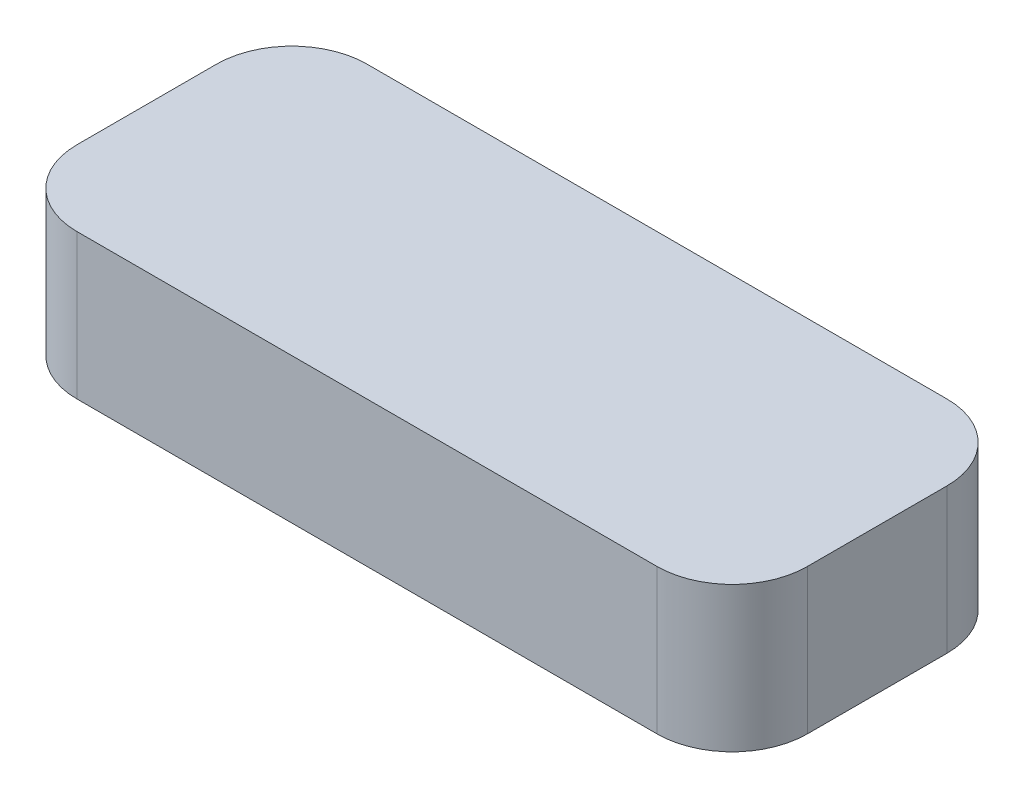
ISO-10303-21;
HEADER;
FILE_DESCRIPTION(('STEP AP214'),'2;1');
FILE_NAME('part.step','',(''),(''),'','','');
FILE_SCHEMA(('AUTOMOTIVE_DESIGN { 1 0 10303 214 1 1 1 1 }'));
ENDSEC;
DATA;
#1=APPLICATION_CONTEXT('core data for automotive mechanical design processes');
#2=APPLICATION_PROTOCOL_DEFINITION('international standard','automotive_design',2000,#1);
#3=PRODUCT_CONTEXT('',#1,'mechanical');
#4=PRODUCT('Part','Part','',(#3));
#5=PRODUCT_RELATED_PRODUCT_CATEGORY('part','',(#4));
#6=PRODUCT_DEFINITION_FORMATION('','',#4);
#7=PRODUCT_DEFINITION_CONTEXT('part definition',#1,'design');
#8=PRODUCT_DEFINITION('design','',#6,#7);
#9=PRODUCT_DEFINITION_SHAPE('','',#8);
#10=(LENGTH_UNIT() NAMED_UNIT(*) SI_UNIT(.MILLI.,.METRE.));
#11=(NAMED_UNIT(*) PLANE_ANGLE_UNIT() SI_UNIT($,.RADIAN.));
#12=(NAMED_UNIT(*) SI_UNIT($,.STERADIAN.) SOLID_ANGLE_UNIT());
#13=UNCERTAINTY_MEASURE_WITH_UNIT(LENGTH_MEASURE(1.E-05),#10,'distance_accuracy_value','');
#14=(GEOMETRIC_REPRESENTATION_CONTEXT(3) GLOBAL_UNCERTAINTY_ASSIGNED_CONTEXT((#13)) GLOBAL_UNIT_ASSIGNED_CONTEXT((#10,
#11,#12)) REPRESENTATION_CONTEXT('',''));
#15=CARTESIAN_POINT('',(0.,0.,0.));
#16=DIRECTION('',(0.,0.,1.));
#17=DIRECTION('',(1.,0.,0.));
#18=AXIS2_PLACEMENT_3D('',#15,#16,#17);
#19=CARTESIAN_POINT('',(215.9,85.725,85.725));
#20=DIRECTION('',(-1.,0.,0.));
#21=DIRECTION('',(0.,0.,1.));
#22=AXIS2_PLACEMENT_3D('',#19,#20,#21);
#23=PLANE('',#22);
#24=DIRECTION('',(0.,0.,-1.));
#25=VECTOR('',#24,1.);
#26=CARTESIAN_POINT('',(215.9,0.,85.725));
#27=LINE('',#26,#25);
#28=CARTESIAN_POINT('',(215.9,0.,41.275));
#29=VERTEX_POINT('',#28);
#30=CARTESIAN_POINT('',(215.9,0.,-41.275));
#31=VERTEX_POINT('',#30);
#32=EDGE_CURVE('E234',#29,#31,#27,.T.);
#33=ORIENTED_EDGE('',*,*,#32,.T.);
#34=DIRECTION('',(0.,-1.,0.));
#35=VECTOR('',#34,1.);
#36=CARTESIAN_POINT('',(215.9,85.725,-41.275));
#37=LINE('',#36,#35);
#38=CARTESIAN_POINT('',(215.9,85.725,-41.275));
#39=VERTEX_POINT('',#38);
#40=EDGE_CURVE('E287',#31,#39,#37,.F.);
#41=ORIENTED_EDGE('',*,*,#40,.T.);
#42=DIRECTION('',(0.,0.,-1.));
#43=VECTOR('',#42,1.);
#44=CARTESIAN_POINT('',(215.9,85.725,85.725));
#45=LINE('',#44,#43);
#46=CARTESIAN_POINT('',(215.9,85.725,41.275));
#47=VERTEX_POINT('',#46);
#48=EDGE_CURVE('E236',#47,#39,#45,.T.);
#49=ORIENTED_EDGE('',*,*,#48,.F.);
#50=DIRECTION('',(0.,-1.,0.));
#51=VECTOR('',#50,1.);
#52=CARTESIAN_POINT('',(215.9,85.725,41.275));
#53=LINE('',#52,#51);
#54=EDGE_CURVE('E283',#47,#29,#53,.T.);
#55=ORIENTED_EDGE('',*,*,#54,.T.);
#56=EDGE_LOOP('',(#33,#41,#49,#55));
#57=FACE_BOUND('',#56,.T.);
#58=ADVANCED_FACE('F44',(#57),#23,.F.);
#59=CARTESIAN_POINT('',(-215.9,85.725,-85.725));
#60=DIRECTION('',(0.,0.,1.));
#61=DIRECTION('',(1.,0.,0.));
#62=AXIS2_PLACEMENT_3D('',#59,#60,#61);
#63=PLANE('',#62);
#64=DIRECTION('',(-1.,0.,0.));
#65=VECTOR('',#64,1.);
#66=CARTESIAN_POINT('',(-215.9,85.725,-85.725));
#67=LINE('',#66,#65);
#68=CARTESIAN_POINT('',(171.45,85.725,-85.725));
#69=VERTEX_POINT('',#68);
#70=CARTESIAN_POINT('',(-171.45,85.725,-85.725));
#71=VERTEX_POINT('',#70);
#72=EDGE_CURVE('E240',#69,#71,#67,.T.);
#73=ORIENTED_EDGE('',*,*,#72,.F.);
#74=DIRECTION('',(0.,-1.,0.));
#75=VECTOR('',#74,1.);
#76=CARTESIAN_POINT('',(171.45,85.725,-85.725));
#77=LINE('',#76,#75);
#78=CARTESIAN_POINT('',(171.45,0.,-85.725));
#79=VERTEX_POINT('',#78);
#80=EDGE_CURVE('E267',#69,#79,#77,.T.);
#81=ORIENTED_EDGE('',*,*,#80,.T.);
#82=DIRECTION('',(-1.,0.,0.));
#83=VECTOR('',#82,1.);
#84=CARTESIAN_POINT('',(-215.9,0.,-85.725));
#85=LINE('',#84,#83);
#86=CARTESIAN_POINT('',(-171.45,0.,-85.725));
#87=VERTEX_POINT('',#86);
#88=EDGE_CURVE('E255',#79,#87,#85,.T.);
#89=ORIENTED_EDGE('',*,*,#88,.T.);
#90=DIRECTION('',(0.,-1.,0.));
#91=VECTOR('',#90,1.);
#92=CARTESIAN_POINT('',(-171.45,85.725,-85.725));
#93=LINE('',#92,#91);
#94=EDGE_CURVE('E251',#87,#71,#93,.F.);
#95=ORIENTED_EDGE('',*,*,#94,.T.);
#96=EDGE_LOOP('',(#73,#81,#89,#95));
#97=FACE_BOUND('',#96,.T.);
#98=ADVANCED_FACE('F338',(#97),#63,.F.);
#99=CARTESIAN_POINT('',(-215.9,85.725,85.725));
#100=DIRECTION('',(1.,0.,0.));
#101=DIRECTION('',(0.,0.,-1.));
#102=AXIS2_PLACEMENT_3D('',#99,#100,#101);
#103=PLANE('',#102);
#104=DIRECTION('',(0.,0.,1.));
#105=VECTOR('',#104,1.);
#106=CARTESIAN_POINT('',(-215.9,0.,85.725));
#107=LINE('',#106,#105);
#108=CARTESIAN_POINT('',(-215.9,0.,-41.275));
#109=VERTEX_POINT('',#108);
#110=CARTESIAN_POINT('',(-215.9,0.,41.275));
#111=VERTEX_POINT('',#110);
#112=EDGE_CURVE('E259',#109,#111,#107,.T.);
#113=ORIENTED_EDGE('',*,*,#112,.T.);
#114=DIRECTION('',(0.,-1.,0.));
#115=VECTOR('',#114,1.);
#116=CARTESIAN_POINT('',(-215.9,85.725,41.275));
#117=LINE('',#116,#115);
#118=CARTESIAN_POINT('',(-215.9,85.725,41.275));
#119=VERTEX_POINT('',#118);
#120=EDGE_CURVE('E12',#111,#119,#117,.F.);
#121=ORIENTED_EDGE('',*,*,#120,.T.);
#122=DIRECTION('',(0.,0.,1.));
#123=VECTOR('',#122,1.);
#124=CARTESIAN_POINT('',(-215.9,85.725,85.725));
#125=LINE('',#124,#123);
#126=CARTESIAN_POINT('',(-215.9,85.725,-41.275));
#127=VERTEX_POINT('',#126);
#128=EDGE_CURVE('E245',#127,#119,#125,.T.);
#129=ORIENTED_EDGE('',*,*,#128,.F.);
#130=DIRECTION('',(0.,-1.,0.));
#131=VECTOR('',#130,1.);
#132=CARTESIAN_POINT('',(-215.9,85.725,-41.275));
#133=LINE('',#132,#131);
#134=EDGE_CURVE('E53',#127,#109,#133,.T.);
#135=ORIENTED_EDGE('',*,*,#134,.T.);
#136=EDGE_LOOP('',(#113,#121,#129,#135));
#137=FACE_BOUND('',#136,.T.);
#138=ADVANCED_FACE('F313',(#137),#103,.F.);
#139=CARTESIAN_POINT('',(-215.9,85.725,85.725));
#140=DIRECTION('',(0.,0.,-1.));
#141=DIRECTION('',(-1.,0.,0.));
#142=AXIS2_PLACEMENT_3D('',#139,#140,#141);
#143=PLANE('',#142);
#144=DIRECTION('',(1.,0.,0.));
#145=VECTOR('',#144,1.);
#146=CARTESIAN_POINT('',(-215.9,0.,85.725));
#147=LINE('',#146,#145);
#148=CARTESIAN_POINT('',(-171.45,0.,85.725));
#149=VERTEX_POINT('',#148);
#150=CARTESIAN_POINT('',(171.45,0.,85.725));
#151=VERTEX_POINT('',#150);
#152=EDGE_CURVE('E241',#149,#151,#147,.T.);
#153=ORIENTED_EDGE('',*,*,#152,.T.);
#154=DIRECTION('',(0.,-1.,0.));
#155=VECTOR('',#154,1.);
#156=CARTESIAN_POINT('',(171.45,85.725,85.725));
#157=LINE('',#156,#155);
#158=CARTESIAN_POINT('',(171.45,85.725,85.725));
#159=VERTEX_POINT('',#158);
#160=EDGE_CURVE('E60',#151,#159,#157,.F.);
#161=ORIENTED_EDGE('',*,*,#160,.T.);
#162=DIRECTION('',(1.,0.,0.));
#163=VECTOR('',#162,1.);
#164=CARTESIAN_POINT('',(-215.9,85.725,85.725));
#165=LINE('',#164,#163);
#166=CARTESIAN_POINT('',(-171.45,85.725,85.725));
#167=VERTEX_POINT('',#166);
#168=EDGE_CURVE('E248',#167,#159,#165,.T.);
#169=ORIENTED_EDGE('',*,*,#168,.F.);
#170=DIRECTION('',(0.,-1.,0.));
#171=VECTOR('',#170,1.);
#172=CARTESIAN_POINT('',(-171.45,85.725,85.725));
#173=LINE('',#172,#171);
#174=EDGE_CURVE('E301',#167,#149,#173,.T.);
#175=ORIENTED_EDGE('',*,*,#174,.T.);
#176=EDGE_LOOP('',(#153,#161,#169,#175));
#177=FACE_BOUND('',#176,.T.);
#178=ADVANCED_FACE('F322',(#177),#143,.F.);
#179=CARTESIAN_POINT('',(0.,85.725,0.));
#180=DIRECTION('',(0.,-1.,0.));
#181=DIRECTION('',(0.,0.,-1.));
#182=AXIS2_PLACEMENT_3D('',#179,#180,#181);
#183=PLANE('',#182);
#184=ORIENTED_EDGE('',*,*,#48,.T.);
#185=CARTESIAN_POINT('',(171.45,85.725,-41.275));
#186=DIRECTION('',(0.,-1.,0.));
#187=DIRECTION('',(0.,0.,-1.));
#188=AXIS2_PLACEMENT_3D('',#185,#186,#187);
#189=CIRCLE('',#188,44.45);
#190=EDGE_CURVE('E298',#39,#69,#189,.F.);
#191=ORIENTED_EDGE('',*,*,#190,.T.);
#192=ORIENTED_EDGE('',*,*,#72,.T.);
#193=CARTESIAN_POINT('',(-171.45,85.725,-41.275));
#194=DIRECTION('',(0.,-1.,0.));
#195=DIRECTION('',(0.,0.,-1.));
#196=AXIS2_PLACEMENT_3D('',#193,#194,#195);
#197=CIRCLE('',#196,44.45);
#198=EDGE_CURVE('E290',#71,#127,#197,.F.);
#199=ORIENTED_EDGE('',*,*,#198,.T.);
#200=ORIENTED_EDGE('',*,*,#128,.T.);
#201=CARTESIAN_POINT('',(-171.45,85.725,41.275));
#202=DIRECTION('',(0.,-1.,0.));
#203=DIRECTION('',(0.,0.,-1.));
#204=AXIS2_PLACEMENT_3D('',#201,#202,#203);
#205=CIRCLE('',#204,44.45);
#206=EDGE_CURVE('E67',#119,#167,#205,.F.);
#207=ORIENTED_EDGE('',*,*,#206,.T.);
#208=ORIENTED_EDGE('',*,*,#168,.T.);
#209=CARTESIAN_POINT('',(171.45,85.725,41.275));
#210=DIRECTION('',(0.,-1.,0.));
#211=DIRECTION('',(0.,0.,-1.));
#212=AXIS2_PLACEMENT_3D('',#209,#210,#211);
#213=CIRCLE('',#212,44.45);
#214=EDGE_CURVE('E295',#159,#47,#213,.F.);
#215=ORIENTED_EDGE('',*,*,#214,.T.);
#216=EDGE_LOOP('',(#184,#191,#192,#199,#200,#207,#208,#215));
#217=FACE_BOUND('',#216,.T.);
#218=ADVANCED_FACE('F324',(#217),#183,.F.);
#219=CARTESIAN_POINT('',(0.,0.,0.));
#220=DIRECTION('',(0.,-1.,0.));
#221=DIRECTION('',(0.,0.,-1.));
#222=AXIS2_PLACEMENT_3D('',#219,#220,#221);
#223=PLANE('',#222);
#224=DIRECTION('',(-1.,0.,0.));
#225=VECTOR('',#224,1.);
#226=CARTESIAN_POINT('',(162.168856379573,0.,76.6864343805733));
#227=LINE('',#226,#225);
#228=CARTESIAN_POINT('',(162.168856379573,0.,76.6864343805733));
#229=VERTEX_POINT('',#228);
#230=CARTESIAN_POINT('',(-162.168856379573,0.,76.6864343805733));
#231=VERTEX_POINT('',#230);
#232=EDGE_CURVE('E182',#229,#231,#227,.T.);
#233=ORIENTED_EDGE('',*,*,#232,.F.);
#234=CARTESIAN_POINT('',(162.168856379573,0.,31.9938563795733));
#235=DIRECTION('',(0.,1.,0.));
#236=DIRECTION('',(0.,0.,1.));
#237=AXIS2_PLACEMENT_3D('',#234,#235,#236);
#238=CIRCLE('',#237,44.692578001);
#239=CARTESIAN_POINT('',(206.861434380573,0.,31.9938563795733));
#240=VERTEX_POINT('',#239);
#241=EDGE_CURVE('E208',#229,#240,#238,.T.);
#242=ORIENTED_EDGE('',*,*,#241,.T.);
#243=DIRECTION('',(0.,0.,1.));
#244=VECTOR('',#243,1.);
#245=CARTESIAN_POINT('',(206.861434380573,0.,-31.9938563795733));
#246=LINE('',#245,#244);
#247=CARTESIAN_POINT('',(206.861434380573,0.,-31.9938563795733));
#248=VERTEX_POINT('',#247);
#249=EDGE_CURVE('E204',#248,#240,#246,.T.);
#250=ORIENTED_EDGE('',*,*,#249,.F.);
#251=CARTESIAN_POINT('',(162.168856379573,0.,-31.9938563795733));
#252=DIRECTION('',(0.,1.,0.));
#253=DIRECTION('',(0.,0.,1.));
#254=AXIS2_PLACEMENT_3D('',#251,#252,#253);
#255=CIRCLE('',#254,44.692578001);
#256=CARTESIAN_POINT('',(162.168856379573,0.,-76.6864343805733));
#257=VERTEX_POINT('',#256);
#258=EDGE_CURVE('E200',#248,#257,#255,.T.);
#259=ORIENTED_EDGE('',*,*,#258,.T.);
#260=DIRECTION('',(1.,0.,0.));
#261=VECTOR('',#260,1.);
#262=CARTESIAN_POINT('',(-162.168856379573,0.,-76.6864343805733));
#263=LINE('',#262,#261);
#264=CARTESIAN_POINT('',(-162.168856379573,0.,-76.6864343805733));
#265=VERTEX_POINT('',#264);
#266=EDGE_CURVE('E193',#265,#257,#263,.T.);
#267=ORIENTED_EDGE('',*,*,#266,.F.);
#268=CARTESIAN_POINT('',(-162.168856379573,0.,-31.9938563795733));
#269=DIRECTION('',(0.,1.,0.));
#270=DIRECTION('',(0.,0.,1.));
#271=AXIS2_PLACEMENT_3D('',#268,#269,#270);
#272=CIRCLE('',#271,44.692578001);
#273=CARTESIAN_POINT('',(-206.861434380573,0.,-31.9938563795733));
#274=VERTEX_POINT('',#273);
#275=EDGE_CURVE('E188',#265,#274,#272,.T.);
#276=ORIENTED_EDGE('',*,*,#275,.T.);
#277=DIRECTION('',(0.,0.,-1.));
#278=VECTOR('',#277,1.);
#279=CARTESIAN_POINT('',(-206.861434380573,0.,31.9938563795733));
#280=LINE('',#279,#278);
#281=CARTESIAN_POINT('',(-206.861434380573,0.,31.9938563795733));
#282=VERTEX_POINT('',#281);
#283=EDGE_CURVE('E164',#282,#274,#280,.T.);
#284=ORIENTED_EDGE('',*,*,#283,.F.);
#285=CARTESIAN_POINT('',(-162.168856379573,0.,31.9938563795733));
#286=DIRECTION('',(0.,-1.,0.));
#287=DIRECTION('',(0.,0.,-1.));
#288=AXIS2_PLACEMENT_3D('',#285,#286,#287);
#289=CIRCLE('',#288,44.692578001);
#290=EDGE_CURVE('E176',#231,#282,#289,.T.);
#291=ORIENTED_EDGE('',*,*,#290,.F.);
#292=EDGE_LOOP('',(#233,#242,#250,#259,#267,#276,#284,#291));
#293=FACE_BOUND('',#292,.T.);
#294=ORIENTED_EDGE('',*,*,#88,.F.);
#295=CARTESIAN_POINT('',(171.45,0.,-41.275));
#296=DIRECTION('',(0.,-1.,0.));
#297=DIRECTION('',(0.,0.,-1.));
#298=AXIS2_PLACEMENT_3D('',#295,#296,#297);
#299=CIRCLE('',#298,44.45);
#300=EDGE_CURVE('E280',#79,#31,#299,.T.);
#301=ORIENTED_EDGE('',*,*,#300,.T.);
#302=ORIENTED_EDGE('',*,*,#32,.F.);
#303=CARTESIAN_POINT('',(171.45,0.,41.275));
#304=DIRECTION('',(0.,-1.,0.));
#305=DIRECTION('',(0.,0.,-1.));
#306=AXIS2_PLACEMENT_3D('',#303,#304,#305);
#307=CIRCLE('',#306,44.45);
#308=EDGE_CURVE('E277',#29,#151,#307,.T.);
#309=ORIENTED_EDGE('',*,*,#308,.T.);
#310=ORIENTED_EDGE('',*,*,#152,.F.);
#311=CARTESIAN_POINT('',(-171.45,0.,41.275));
#312=DIRECTION('',(0.,-1.,0.));
#313=DIRECTION('',(0.,0.,-1.));
#314=AXIS2_PLACEMENT_3D('',#311,#312,#313);
#315=CIRCLE('',#314,44.45);
#316=EDGE_CURVE('E274',#149,#111,#315,.T.);
#317=ORIENTED_EDGE('',*,*,#316,.T.);
#318=ORIENTED_EDGE('',*,*,#112,.F.);
#319=CARTESIAN_POINT('',(-171.45,0.,-41.275));
#320=DIRECTION('',(0.,-1.,0.));
#321=DIRECTION('',(0.,0.,-1.));
#322=AXIS2_PLACEMENT_3D('',#319,#320,#321);
#323=CIRCLE('',#322,44.45);
#324=EDGE_CURVE('E271',#109,#87,#323,.T.);
#325=ORIENTED_EDGE('',*,*,#324,.T.);
#326=EDGE_LOOP('',(#294,#301,#302,#309,#310,#317,#318,#325));
#327=FACE_BOUND('',#326,.T.);
#328=ADVANCED_FACE('F184',(#293,#327),#223,.T.);
#329=CARTESIAN_POINT('',(162.168856379573,526.961726721583,76.6864343805733));
#330=DIRECTION('',(0.,0.,1.));
#331=DIRECTION('',(1.,0.,0.));
#332=AXIS2_PLACEMENT_3D('',#329,#330,#331);
#333=PLANE('',#332);
#334=DIRECTION('',(1.,0.,0.));
#335=VECTOR('',#334,1.);
#336=CARTESIAN_POINT('',(162.168856379573,73.025,76.6864343805733));
#337=LINE('',#336,#335);
#338=CARTESIAN_POINT('',(-162.168856379573,73.025,76.6864343805733));
#339=VERTEX_POINT('',#338);
#340=CARTESIAN_POINT('',(162.168856379573,73.025,76.6864343805733));
#341=VERTEX_POINT('',#340);
#342=EDGE_CURVE('E235',#339,#341,#337,.T.);
#343=ORIENTED_EDGE('',*,*,#342,.T.);
#344=DIRECTION('',(0.,-1.,0.));
#345=VECTOR('',#344,1.);
#346=CARTESIAN_POINT('',(162.168856379573,526.961726721583,76.6864343805733));
#347=LINE('',#346,#345);
#348=EDGE_CURVE('E212',#341,#229,#347,.T.);
#349=ORIENTED_EDGE('',*,*,#348,.T.);
#350=ORIENTED_EDGE('',*,*,#232,.T.);
#351=DIRECTION('',(0.,-1.,0.));
#352=VECTOR('',#351,1.);
#353=CARTESIAN_POINT('',(-162.168856379573,526.961726721583,76.6864343805733));
#354=LINE('',#353,#352);
#355=EDGE_CURVE('E172',#339,#231,#354,.T.);
#356=ORIENTED_EDGE('',*,*,#355,.F.);
#357=EDGE_LOOP('',(#343,#349,#350,#356));
#358=FACE_BOUND('',#357,.T.);
#359=ADVANCED_FACE('F382',(#358),#333,.F.);
#360=CARTESIAN_POINT('',(162.168856379573,526.961726721583,31.9938563795733));
#361=DIRECTION('',(0.,-1.,0.));
#362=DIRECTION('',(0.,0.,-1.));
#363=AXIS2_PLACEMENT_3D('',#360,#361,#362);
#364=CYLINDRICAL_SURFACE('',#363,44.692578001);
#365=DIRECTION('',(0.,-1.,0.));
#366=VECTOR('',#365,1.);
#367=CARTESIAN_POINT('',(206.861434380573,526.961726721583,31.9938563795733));
#368=LINE('',#367,#366);
#369=CARTESIAN_POINT('',(206.861434380573,73.025,31.9938563795733));
#370=VERTEX_POINT('',#369);
#371=EDGE_CURVE('E215',#370,#240,#368,.T.);
#372=ORIENTED_EDGE('',*,*,#371,.T.);
#373=ORIENTED_EDGE('',*,*,#241,.F.);
#374=ORIENTED_EDGE('',*,*,#348,.F.);
#375=CARTESIAN_POINT('',(162.168856379573,73.025,31.9938563795733));
#376=DIRECTION('',(0.,-1.,0.));
#377=DIRECTION('',(0.,0.,-1.));
#378=AXIS2_PLACEMENT_3D('',#375,#376,#377);
#379=CIRCLE('',#378,44.692578001);
#380=EDGE_CURVE('E575',#370,#341,#379,.T.);
#381=ORIENTED_EDGE('',*,*,#380,.F.);
#382=EDGE_LOOP('',(#372,#373,#374,#381));
#383=FACE_BOUND('',#382,.T.);
#384=ADVANCED_FACE('F435',(#383),#364,.F.);
#385=CARTESIAN_POINT('',(206.861434380573,526.961726721583,-31.9938563795733));
#386=DIRECTION('',(1.,0.,0.));
#387=DIRECTION('',(0.,0.,-1.));
#388=AXIS2_PLACEMENT_3D('',#385,#386,#387);
#389=PLANE('',#388);
#390=DIRECTION('',(0.,0.,-1.));
#391=VECTOR('',#390,1.);
#392=CARTESIAN_POINT('',(206.861434380573,73.025,-31.9938563795733));
#393=LINE('',#392,#391);
#394=CARTESIAN_POINT('',(206.861434380573,73.025,-31.9938563795733));
#395=VERTEX_POINT('',#394);
#396=EDGE_CURVE('E585',#370,#395,#393,.T.);
#397=ORIENTED_EDGE('',*,*,#396,.T.);
#398=DIRECTION('',(0.,-1.,0.));
#399=VECTOR('',#398,1.);
#400=CARTESIAN_POINT('',(206.861434380573,526.961726721583,-31.9938563795733));
#401=LINE('',#400,#399);
#402=EDGE_CURVE('E218',#395,#248,#401,.T.);
#403=ORIENTED_EDGE('',*,*,#402,.T.);
#404=ORIENTED_EDGE('',*,*,#249,.T.);
#405=ORIENTED_EDGE('',*,*,#371,.F.);
#406=EDGE_LOOP('',(#397,#403,#404,#405));
#407=FACE_BOUND('',#406,.T.);
#408=ADVANCED_FACE('F443',(#407),#389,.F.);
#409=CARTESIAN_POINT('',(162.168856379573,526.961726721583,-31.9938563795733));
#410=DIRECTION('',(0.,-1.,0.));
#411=DIRECTION('',(0.,0.,-1.));
#412=AXIS2_PLACEMENT_3D('',#409,#410,#411);
#413=CYLINDRICAL_SURFACE('',#412,44.692578001);
#414=DIRECTION('',(0.,-1.,0.));
#415=VECTOR('',#414,1.);
#416=CARTESIAN_POINT('',(162.168856379573,526.961726721583,-76.6864343805733));
#417=LINE('',#416,#415);
#418=CARTESIAN_POINT('',(162.168856379573,73.025,-76.6864343805733));
#419=VERTEX_POINT('',#418);
#420=EDGE_CURVE('E221',#419,#257,#417,.T.);
#421=ORIENTED_EDGE('',*,*,#420,.T.);
#422=ORIENTED_EDGE('',*,*,#258,.F.);
#423=ORIENTED_EDGE('',*,*,#402,.F.);
#424=CARTESIAN_POINT('',(162.168856379573,73.025,-31.9938563795733));
#425=DIRECTION('',(0.,-1.,0.));
#426=DIRECTION('',(0.,0.,-1.));
#427=AXIS2_PLACEMENT_3D('',#424,#425,#426);
#428=CIRCLE('',#427,44.692578001);
#429=EDGE_CURVE('E588',#419,#395,#428,.T.);
#430=ORIENTED_EDGE('',*,*,#429,.F.);
#431=EDGE_LOOP('',(#421,#422,#423,#430));
#432=FACE_BOUND('',#431,.T.);
#433=ADVANCED_FACE('F451',(#432),#413,.F.);
#434=CARTESIAN_POINT('',(-162.168856379573,526.961726721583,-76.6864343805733));
#435=DIRECTION('',(0.,0.,-1.));
#436=DIRECTION('',(-1.,0.,0.));
#437=AXIS2_PLACEMENT_3D('',#434,#435,#436);
#438=PLANE('',#437);
#439=DIRECTION('',(-1.,0.,0.));
#440=VECTOR('',#439,1.);
#441=CARTESIAN_POINT('',(-162.168856379573,73.025,-76.6864343805733));
#442=LINE('',#441,#440);
#443=CARTESIAN_POINT('',(-162.168856379573,73.025,-76.6864343805733));
#444=VERTEX_POINT('',#443);
#445=EDGE_CURVE('E592',#419,#444,#442,.T.);
#446=ORIENTED_EDGE('',*,*,#445,.T.);
#447=DIRECTION('',(0.,-1.,0.));
#448=VECTOR('',#447,1.);
#449=CARTESIAN_POINT('',(-162.168856379573,526.961726721583,-76.6864343805733));
#450=LINE('',#449,#448);
#451=EDGE_CURVE('E224',#444,#265,#450,.T.);
#452=ORIENTED_EDGE('',*,*,#451,.T.);
#453=ORIENTED_EDGE('',*,*,#266,.T.);
#454=ORIENTED_EDGE('',*,*,#420,.F.);
#455=EDGE_LOOP('',(#446,#452,#453,#454));
#456=FACE_BOUND('',#455,.T.);
#457=ADVANCED_FACE('F459',(#456),#438,.F.);
#458=CARTESIAN_POINT('',(-162.168856379573,526.961726721583,-31.9938563795733));
#459=DIRECTION('',(0.,-1.,0.));
#460=DIRECTION('',(0.,0.,-1.));
#461=AXIS2_PLACEMENT_3D('',#458,#459,#460);
#462=CYLINDRICAL_SURFACE('',#461,44.692578001);
#463=DIRECTION('',(0.,-1.,0.));
#464=VECTOR('',#463,1.);
#465=CARTESIAN_POINT('',(-206.861434380573,526.961726721583,-31.9938563795733));
#466=LINE('',#465,#464);
#467=CARTESIAN_POINT('',(-206.861434380573,73.025,-31.9938563795733));
#468=VERTEX_POINT('',#467);
#469=EDGE_CURVE('E171',#468,#274,#466,.T.);
#470=ORIENTED_EDGE('',*,*,#469,.T.);
#471=ORIENTED_EDGE('',*,*,#275,.F.);
#472=ORIENTED_EDGE('',*,*,#451,.F.);
#473=CARTESIAN_POINT('',(-162.168856379573,73.025,-31.9938563795733));
#474=DIRECTION('',(0.,-1.,0.));
#475=DIRECTION('',(0.,0.,-1.));
#476=AXIS2_PLACEMENT_3D('',#473,#474,#475);
#477=CIRCLE('',#476,44.692578001);
#478=EDGE_CURVE('E595',#468,#444,#477,.T.);
#479=ORIENTED_EDGE('',*,*,#478,.F.);
#480=EDGE_LOOP('',(#470,#471,#472,#479));
#481=FACE_BOUND('',#480,.T.);
#482=ADVANCED_FACE('F467',(#481),#462,.F.);
#483=CARTESIAN_POINT('',(-206.861434380573,526.961726721583,31.9938563795733));
#484=DIRECTION('',(-1.,0.,0.));
#485=DIRECTION('',(0.,0.,1.));
#486=AXIS2_PLACEMENT_3D('',#483,#484,#485);
#487=PLANE('',#486);
#488=DIRECTION('',(0.,0.,1.));
#489=VECTOR('',#488,1.);
#490=CARTESIAN_POINT('',(-206.861434380573,73.025,31.9938563795733));
#491=LINE('',#490,#489);
#492=CARTESIAN_POINT('',(-206.861434380573,73.025,31.9938563795733));
#493=VERTEX_POINT('',#492);
#494=EDGE_CURVE('E167',#468,#493,#491,.T.);
#495=ORIENTED_EDGE('',*,*,#494,.T.);
#496=DIRECTION('',(0.,-1.,0.));
#497=VECTOR('',#496,1.);
#498=CARTESIAN_POINT('',(-206.861434380573,526.961726721583,31.9938563795733));
#499=LINE('',#498,#497);
#500=EDGE_CURVE('E159',#493,#282,#499,.T.);
#501=ORIENTED_EDGE('',*,*,#500,.T.);
#502=ORIENTED_EDGE('',*,*,#283,.T.);
#503=ORIENTED_EDGE('',*,*,#469,.F.);
#504=EDGE_LOOP('',(#495,#501,#502,#503));
#505=FACE_BOUND('',#504,.T.);
#506=ADVANCED_FACE('F161',(#505),#487,.F.);
#507=CARTESIAN_POINT('',(-162.168856379573,526.961726721583,31.9938563795733));
#508=DIRECTION('',(0.,-1.,0.));
#509=DIRECTION('',(0.,0.,-1.));
#510=AXIS2_PLACEMENT_3D('',#507,#508,#509);
#511=CYLINDRICAL_SURFACE('',#510,44.692578001);
#512=CARTESIAN_POINT('',(-162.168856379573,73.025,31.9938563795733));
#513=DIRECTION('',(0.,-1.,0.));
#514=DIRECTION('',(0.,0.,-1.));
#515=AXIS2_PLACEMENT_3D('',#512,#513,#514);
#516=CIRCLE('',#515,44.692578001);
#517=EDGE_CURVE('E231',#493,#339,#516,.F.);
#518=ORIENTED_EDGE('',*,*,#517,.T.);
#519=ORIENTED_EDGE('',*,*,#355,.T.);
#520=ORIENTED_EDGE('',*,*,#290,.T.);
#521=ORIENTED_EDGE('',*,*,#500,.F.);
#522=EDGE_LOOP('',(#518,#519,#520,#521));
#523=FACE_BOUND('',#522,.T.);
#524=ADVANCED_FACE('F177',(#523),#511,.F.);
#525=CARTESIAN_POINT('',(0.,73.025,0.));
#526=DIRECTION('',(0.,-1.,0.));
#527=DIRECTION('',(0.,0.,-1.));
#528=AXIS2_PLACEMENT_3D('',#525,#526,#527);
#529=PLANE('',#528);
#530=ORIENTED_EDGE('',*,*,#342,.F.);
#531=ORIENTED_EDGE('',*,*,#517,.F.);
#532=ORIENTED_EDGE('',*,*,#494,.F.);
#533=ORIENTED_EDGE('',*,*,#478,.T.);
#534=ORIENTED_EDGE('',*,*,#445,.F.);
#535=ORIENTED_EDGE('',*,*,#429,.T.);
#536=ORIENTED_EDGE('',*,*,#396,.F.);
#537=ORIENTED_EDGE('',*,*,#380,.T.);
#538=EDGE_LOOP('',(#530,#531,#532,#533,#534,#535,#536,#537));
#539=FACE_BOUND('',#538,.T.);
#540=ADVANCED_FACE('F354',(#539),#529,.T.);
#541=CARTESIAN_POINT('',(171.45,85.725,-41.275));
#542=DIRECTION('',(0.,-1.,0.));
#543=DIRECTION('',(0.,0.,-1.));
#544=AXIS2_PLACEMENT_3D('',#541,#542,#543);
#545=CYLINDRICAL_SURFACE('',#544,44.45);
#546=ORIENTED_EDGE('',*,*,#190,.F.);
#547=ORIENTED_EDGE('',*,*,#40,.F.);
#548=ORIENTED_EDGE('',*,*,#300,.F.);
#549=ORIENTED_EDGE('',*,*,#80,.F.);
#550=EDGE_LOOP('',(#546,#547,#548,#549));
#551=FACE_BOUND('',#550,.T.);
#552=ADVANCED_FACE('F335',(#551),#545,.T.);
#553=CARTESIAN_POINT('',(171.45,85.725,41.275));
#554=DIRECTION('',(0.,-1.,0.));
#555=DIRECTION('',(0.,0.,-1.));
#556=AXIS2_PLACEMENT_3D('',#553,#554,#555);
#557=CYLINDRICAL_SURFACE('',#556,44.45);
#558=ORIENTED_EDGE('',*,*,#214,.F.);
#559=ORIENTED_EDGE('',*,*,#160,.F.);
#560=ORIENTED_EDGE('',*,*,#308,.F.);
#561=ORIENTED_EDGE('',*,*,#54,.F.);
#562=EDGE_LOOP('',(#558,#559,#560,#561));
#563=FACE_BOUND('',#562,.T.);
#564=ADVANCED_FACE('F328',(#563),#557,.T.);
#565=CARTESIAN_POINT('',(-171.45,85.725,41.275));
#566=DIRECTION('',(0.,-1.,0.));
#567=DIRECTION('',(0.,0.,-1.));
#568=AXIS2_PLACEMENT_3D('',#565,#566,#567);
#569=CYLINDRICAL_SURFACE('',#568,44.45);
#570=ORIENTED_EDGE('',*,*,#206,.F.);
#571=ORIENTED_EDGE('',*,*,#120,.F.);
#572=ORIENTED_EDGE('',*,*,#316,.F.);
#573=ORIENTED_EDGE('',*,*,#174,.F.);
#574=EDGE_LOOP('',(#570,#571,#572,#573));
#575=FACE_BOUND('',#574,.T.);
#576=ADVANCED_FACE('F321',(#575),#569,.T.);
#577=CARTESIAN_POINT('',(-171.45,85.725,-41.275));
#578=DIRECTION('',(0.,-1.,0.));
#579=DIRECTION('',(0.,0.,-1.));
#580=AXIS2_PLACEMENT_3D('',#577,#578,#579);
#581=CYLINDRICAL_SURFACE('',#580,44.45);
#582=ORIENTED_EDGE('',*,*,#198,.F.);
#583=ORIENTED_EDGE('',*,*,#94,.F.);
#584=ORIENTED_EDGE('',*,*,#324,.F.);
#585=ORIENTED_EDGE('',*,*,#134,.F.);
#586=EDGE_LOOP('',(#582,#583,#584,#585));
#587=FACE_BOUND('',#586,.T.);
#588=ADVANCED_FACE('F46',(#587),#581,.T.);
#589=CLOSED_SHELL('',(#58,#98,#138,#178,#218,#328,#359,#384,#408,#433,#457,#482,#506,#524,#540,
#552,#564,#576,#588));
#590=MANIFOLD_SOLID_BREP('B2',#589);
#591=ADVANCED_BREP_SHAPE_REPRESENTATION('',(#18,#590),#14);
#592=SHAPE_DEFINITION_REPRESENTATION(#9,#591);
ENDSEC;
END-ISO-10303-21;
